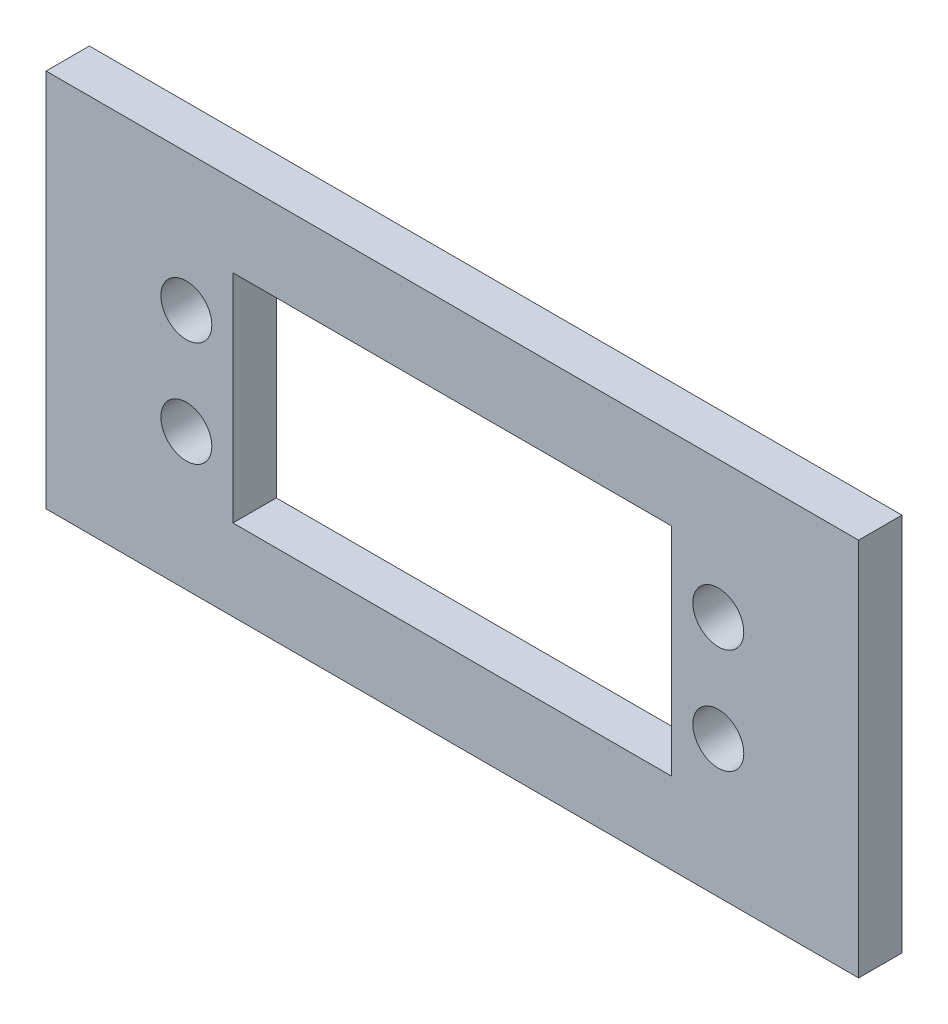
ISO-10303-21;
HEADER;
FILE_DESCRIPTION(('STEP AP214'),'2;1');
FILE_NAME('part.step','',(''),(''),'','','');
FILE_SCHEMA(('AUTOMOTIVE_DESIGN { 1 0 10303 214 1 1 1 1 }'));
ENDSEC;
DATA;
#1=APPLICATION_CONTEXT('core data for automotive mechanical design processes');
#2=APPLICATION_PROTOCOL_DEFINITION('international standard','automotive_design',2000,#1);
#3=PRODUCT_CONTEXT('',#1,'mechanical');
#4=PRODUCT('Part','Part','',(#3));
#5=PRODUCT_RELATED_PRODUCT_CATEGORY('part','',(#4));
#6=PRODUCT_DEFINITION_FORMATION('','',#4);
#7=PRODUCT_DEFINITION_CONTEXT('part definition',#1,'design');
#8=PRODUCT_DEFINITION('design','',#6,#7);
#9=PRODUCT_DEFINITION_SHAPE('','',#8);
#10=(LENGTH_UNIT() NAMED_UNIT(*) SI_UNIT(.MILLI.,.METRE.));
#11=(NAMED_UNIT(*) PLANE_ANGLE_UNIT() SI_UNIT($,.RADIAN.));
#12=(NAMED_UNIT(*) SI_UNIT($,.STERADIAN.) SOLID_ANGLE_UNIT());
#13=UNCERTAINTY_MEASURE_WITH_UNIT(LENGTH_MEASURE(1.E-05),#10,'distance_accuracy_value','');
#14=(GEOMETRIC_REPRESENTATION_CONTEXT(3) GLOBAL_UNCERTAINTY_ASSIGNED_CONTEXT((#13)) GLOBAL_UNIT_ASSIGNED_CONTEXT((#10,
#11,#12)) REPRESENTATION_CONTEXT('',''));
#15=CARTESIAN_POINT('',(0.,0.,0.));
#16=DIRECTION('',(0.,0.,1.));
#17=DIRECTION('',(1.,0.,0.));
#18=AXIS2_PLACEMENT_3D('',#15,#16,#17);
#19=CARTESIAN_POINT('',(0.,0.,4.));
#20=DIRECTION('',(0.,0.,1.));
#21=DIRECTION('',(1.,0.,0.));
#22=AXIS2_PLACEMENT_3D('',#19,#20,#21);
#23=PLANE('',#22);
#24=CARTESIAN_POINT('',(24.55,-4.85,4.));
#25=DIRECTION('',(0.,0.,1.));
#26=DIRECTION('',(1.,0.,0.));
#27=AXIS2_PLACEMENT_3D('',#24,#25,#26);
#28=CIRCLE('',#27,2.35);
#29=CARTESIAN_POINT('',(26.9,-4.85,4.));
#30=VERTEX_POINT('',#29);
#31=EDGE_CURVE('E144',#30,#30,#28,.T.);
#32=ORIENTED_EDGE('',*,*,#31,.F.);
#33=EDGE_LOOP('',(#32));
#34=FACE_BOUND('',#33,.T.);
#35=CARTESIAN_POINT('',(-24.55,4.85,4.));
#36=DIRECTION('',(0.,0.,1.));
#37=DIRECTION('',(1.,0.,0.));
#38=AXIS2_PLACEMENT_3D('',#35,#36,#37);
#39=CIRCLE('',#38,2.35);
#40=CARTESIAN_POINT('',(-22.2,4.85,4.));
#41=VERTEX_POINT('',#40);
#42=EDGE_CURVE('E156',#41,#41,#39,.T.);
#43=ORIENTED_EDGE('',*,*,#42,.F.);
#44=EDGE_LOOP('',(#43));
#45=FACE_BOUND('',#44,.T.);
#46=DIRECTION('',(0.,-1.,0.));
#47=VECTOR('',#46,1.);
#48=CARTESIAN_POINT('',(-37.5,17.5,4.));
#49=LINE('',#48,#47);
#50=CARTESIAN_POINT('',(-37.5,17.5,4.));
#51=VERTEX_POINT('',#50);
#52=CARTESIAN_POINT('',(-37.5,-17.5,4.));
#53=VERTEX_POINT('',#52);
#54=EDGE_CURVE('E162',#51,#53,#49,.T.);
#55=ORIENTED_EDGE('',*,*,#54,.T.);
#56=DIRECTION('',(1.,0.,0.));
#57=VECTOR('',#56,1.);
#58=CARTESIAN_POINT('',(-37.5,-17.5,4.));
#59=LINE('',#58,#57);
#60=CARTESIAN_POINT('',(37.5,-17.5,4.));
#61=VERTEX_POINT('',#60);
#62=EDGE_CURVE('E165',#53,#61,#59,.T.);
#63=ORIENTED_EDGE('',*,*,#62,.T.);
#64=DIRECTION('',(0.,1.,0.));
#65=VECTOR('',#64,1.);
#66=CARTESIAN_POINT('',(37.5,17.5,4.));
#67=LINE('',#66,#65);
#68=CARTESIAN_POINT('',(37.5,17.5,4.));
#69=VERTEX_POINT('',#68);
#70=EDGE_CURVE('E168',#61,#69,#67,.T.);
#71=ORIENTED_EDGE('',*,*,#70,.T.);
#72=DIRECTION('',(-1.,0.,0.));
#73=VECTOR('',#72,1.);
#74=CARTESIAN_POINT('',(-37.5,17.5,4.));
#75=LINE('',#74,#73);
#76=EDGE_CURVE('E170',#69,#51,#75,.T.);
#77=ORIENTED_EDGE('',*,*,#76,.T.);
#78=EDGE_LOOP('',(#55,#63,#71,#77));
#79=FACE_BOUND('',#78,.T.);
#80=CARTESIAN_POINT('',(-24.55,-4.85,4.));
#81=DIRECTION('',(0.,0.,1.));
#82=DIRECTION('',(1.,0.,0.));
#83=AXIS2_PLACEMENT_3D('',#80,#81,#82);
#84=CIRCLE('',#83,2.34999999999999);
#85=CARTESIAN_POINT('',(-22.2,-4.85,4.));
#86=VERTEX_POINT('',#85);
#87=EDGE_CURVE('E150',#86,#86,#84,.T.);
#88=ORIENTED_EDGE('',*,*,#87,.F.);
#89=EDGE_LOOP('',(#88));
#90=FACE_BOUND('',#89,.T.);
#91=CARTESIAN_POINT('',(24.55,4.85,4.));
#92=DIRECTION('',(0.,0.,1.));
#93=DIRECTION('',(1.,0.,0.));
#94=AXIS2_PLACEMENT_3D('',#91,#92,#93);
#95=CIRCLE('',#94,2.35);
#96=CARTESIAN_POINT('',(26.9,4.85,4.));
#97=VERTEX_POINT('',#96);
#98=EDGE_CURVE('E138',#97,#97,#95,.T.);
#99=ORIENTED_EDGE('',*,*,#98,.F.);
#100=EDGE_LOOP('',(#99));
#101=FACE_BOUND('',#100,.T.);
#102=DIRECTION('',(1.,0.,0.));
#103=VECTOR('',#102,1.);
#104=CARTESIAN_POINT('',(-20.25,-10.,4.));
#105=LINE('',#104,#103);
#106=CARTESIAN_POINT('',(-20.25,-10.,4.));
#107=VERTEX_POINT('',#106);
#108=CARTESIAN_POINT('',(20.25,-10.,4.));
#109=VERTEX_POINT('',#108);
#110=EDGE_CURVE('E110',#107,#109,#105,.T.);
#111=ORIENTED_EDGE('',*,*,#110,.F.);
#112=DIRECTION('',(0.,-1.,0.));
#113=VECTOR('',#112,1.);
#114=CARTESIAN_POINT('',(-20.25,10.,4.));
#115=LINE('',#114,#113);
#116=CARTESIAN_POINT('',(-20.25,10.,4.));
#117=VERTEX_POINT('',#116);
#118=EDGE_CURVE('E102',#117,#107,#115,.T.);
#119=ORIENTED_EDGE('',*,*,#118,.F.);
#120=DIRECTION('',(-1.,0.,0.));
#121=VECTOR('',#120,1.);
#122=CARTESIAN_POINT('',(-20.25,10.,4.));
#123=LINE('',#122,#121);
#124=CARTESIAN_POINT('',(20.25,10.,4.));
#125=VERTEX_POINT('',#124);
#126=EDGE_CURVE('E124',#125,#117,#123,.T.);
#127=ORIENTED_EDGE('',*,*,#126,.F.);
#128=DIRECTION('',(0.,1.,0.));
#129=VECTOR('',#128,1.);
#130=CARTESIAN_POINT('',(20.25,10.,4.));
#131=LINE('',#130,#129);
#132=EDGE_CURVE('E122',#109,#125,#131,.T.);
#133=ORIENTED_EDGE('',*,*,#132,.F.);
#134=EDGE_LOOP('',(#111,#119,#127,#133));
#135=FACE_BOUND('',#134,.T.);
#136=ADVANCED_FACE('F37',(#34,#45,#79,#90,#101,#135),#23,.T.);
#137=CARTESIAN_POINT('',(0.,0.,0.));
#138=DIRECTION('',(0.,0.,1.));
#139=DIRECTION('',(1.,0.,0.));
#140=AXIS2_PLACEMENT_3D('',#137,#138,#139);
#141=PLANE('',#140);
#142=CARTESIAN_POINT('',(24.55,4.85,0.));
#143=DIRECTION('',(0.,0.,1.));
#144=DIRECTION('',(1.,0.,0.));
#145=AXIS2_PLACEMENT_3D('',#142,#143,#144);
#146=CIRCLE('',#145,2.35);
#147=CARTESIAN_POINT('',(26.9,4.85,0.));
#148=VERTEX_POINT('',#147);
#149=EDGE_CURVE('E118',#148,#148,#146,.T.);
#150=ORIENTED_EDGE('',*,*,#149,.T.);
#151=EDGE_LOOP('',(#150));
#152=FACE_BOUND('',#151,.T.);
#153=CARTESIAN_POINT('',(24.55,-4.85,0.));
#154=DIRECTION('',(0.,0.,1.));
#155=DIRECTION('',(1.,0.,0.));
#156=AXIS2_PLACEMENT_3D('',#153,#154,#155);
#157=CIRCLE('',#156,2.35);
#158=CARTESIAN_POINT('',(26.9,-4.85,0.));
#159=VERTEX_POINT('',#158);
#160=EDGE_CURVE('E141',#159,#159,#157,.T.);
#161=ORIENTED_EDGE('',*,*,#160,.T.);
#162=EDGE_LOOP('',(#161));
#163=FACE_BOUND('',#162,.T.);
#164=CARTESIAN_POINT('',(-24.55,-4.85,0.));
#165=DIRECTION('',(0.,0.,1.));
#166=DIRECTION('',(1.,0.,0.));
#167=AXIS2_PLACEMENT_3D('',#164,#165,#166);
#168=CIRCLE('',#167,2.34999999999999);
#169=CARTESIAN_POINT('',(-22.2,-4.85,0.));
#170=VERTEX_POINT('',#169);
#171=EDGE_CURVE('E147',#170,#170,#168,.T.);
#172=ORIENTED_EDGE('',*,*,#171,.T.);
#173=EDGE_LOOP('',(#172));
#174=FACE_BOUND('',#173,.T.);
#175=CARTESIAN_POINT('',(-24.55,4.85,0.));
#176=DIRECTION('',(0.,0.,1.));
#177=DIRECTION('',(1.,0.,0.));
#178=AXIS2_PLACEMENT_3D('',#175,#176,#177);
#179=CIRCLE('',#178,2.35);
#180=CARTESIAN_POINT('',(-22.2,4.85,0.));
#181=VERTEX_POINT('',#180);
#182=EDGE_CURVE('E153',#181,#181,#179,.T.);
#183=ORIENTED_EDGE('',*,*,#182,.T.);
#184=EDGE_LOOP('',(#183));
#185=FACE_BOUND('',#184,.T.);
#186=DIRECTION('',(0.,-1.,0.));
#187=VECTOR('',#186,1.);
#188=CARTESIAN_POINT('',(-37.5,17.5,0.));
#189=LINE('',#188,#187);
#190=CARTESIAN_POINT('',(-37.5,17.5,0.));
#191=VERTEX_POINT('',#190);
#192=CARTESIAN_POINT('',(-37.5,-17.5,0.));
#193=VERTEX_POINT('',#192);
#194=EDGE_CURVE('E159',#191,#193,#189,.T.);
#195=ORIENTED_EDGE('',*,*,#194,.F.);
#196=DIRECTION('',(-1.,0.,0.));
#197=VECTOR('',#196,1.);
#198=CARTESIAN_POINT('',(-37.5,17.5,0.));
#199=LINE('',#198,#197);
#200=CARTESIAN_POINT('',(37.5,17.5,0.));
#201=VERTEX_POINT('',#200);
#202=EDGE_CURVE('E166',#201,#191,#199,.T.);
#203=ORIENTED_EDGE('',*,*,#202,.F.);
#204=DIRECTION('',(0.,1.,0.));
#205=VECTOR('',#204,1.);
#206=CARTESIAN_POINT('',(37.5,17.5,0.));
#207=LINE('',#206,#205);
#208=CARTESIAN_POINT('',(37.5,-17.5,0.));
#209=VERTEX_POINT('',#208);
#210=EDGE_CURVE('E177',#209,#201,#207,.T.);
#211=ORIENTED_EDGE('',*,*,#210,.F.);
#212=DIRECTION('',(1.,0.,0.));
#213=VECTOR('',#212,1.);
#214=CARTESIAN_POINT('',(-37.5,-17.5,0.));
#215=LINE('',#214,#213);
#216=EDGE_CURVE('E175',#193,#209,#215,.T.);
#217=ORIENTED_EDGE('',*,*,#216,.F.);
#218=EDGE_LOOP('',(#195,#203,#211,#217));
#219=FACE_BOUND('',#218,.T.);
#220=DIRECTION('',(0.,-1.,0.));
#221=VECTOR('',#220,1.);
#222=CARTESIAN_POINT('',(-20.25,10.,0.));
#223=LINE('',#222,#221);
#224=CARTESIAN_POINT('',(-20.25,10.,0.));
#225=VERTEX_POINT('',#224);
#226=CARTESIAN_POINT('',(-20.25,-10.,0.));
#227=VERTEX_POINT('',#226);
#228=EDGE_CURVE('E60',#225,#227,#223,.T.);
#229=ORIENTED_EDGE('',*,*,#228,.T.);
#230=DIRECTION('',(1.,0.,0.));
#231=VECTOR('',#230,1.);
#232=CARTESIAN_POINT('',(-20.25,-10.,0.));
#233=LINE('',#232,#231);
#234=CARTESIAN_POINT('',(20.25,-10.,0.));
#235=VERTEX_POINT('',#234);
#236=EDGE_CURVE('E117',#227,#235,#233,.T.);
#237=ORIENTED_EDGE('',*,*,#236,.T.);
#238=DIRECTION('',(0.,1.,0.));
#239=VECTOR('',#238,1.);
#240=CARTESIAN_POINT('',(20.25,10.,0.));
#241=LINE('',#240,#239);
#242=CARTESIAN_POINT('',(20.25,10.,0.));
#243=VERTEX_POINT('',#242);
#244=EDGE_CURVE('E130',#235,#243,#241,.T.);
#245=ORIENTED_EDGE('',*,*,#244,.T.);
#246=DIRECTION('',(-1.,0.,0.));
#247=VECTOR('',#246,1.);
#248=CARTESIAN_POINT('',(-20.25,10.,0.));
#249=LINE('',#248,#247);
#250=EDGE_CURVE('E111',#243,#225,#249,.T.);
#251=ORIENTED_EDGE('',*,*,#250,.T.);
#252=EDGE_LOOP('',(#229,#237,#245,#251));
#253=FACE_BOUND('',#252,.T.);
#254=ADVANCED_FACE('F195',(#152,#163,#174,#185,#219,#253),#141,.F.);
#255=CARTESIAN_POINT('',(-37.5,17.5,4.));
#256=DIRECTION('',(1.,0.,0.));
#257=DIRECTION('',(0.,0.,-1.));
#258=AXIS2_PLACEMENT_3D('',#255,#256,#257);
#259=PLANE('',#258);
#260=ORIENTED_EDGE('',*,*,#194,.T.);
#261=DIRECTION('',(0.,0.,-1.));
#262=VECTOR('',#261,1.);
#263=CARTESIAN_POINT('',(-37.5,-17.5,4.));
#264=LINE('',#263,#262);
#265=EDGE_CURVE('E11',#53,#193,#264,.T.);
#266=ORIENTED_EDGE('',*,*,#265,.F.);
#267=ORIENTED_EDGE('',*,*,#54,.F.);
#268=DIRECTION('',(0.,0.,-1.));
#269=VECTOR('',#268,1.);
#270=CARTESIAN_POINT('',(-37.5,17.5,4.));
#271=LINE('',#270,#269);
#272=EDGE_CURVE('E172',#51,#191,#271,.T.);
#273=ORIENTED_EDGE('',*,*,#272,.T.);
#274=EDGE_LOOP('',(#260,#266,#267,#273));
#275=FACE_BOUND('',#274,.T.);
#276=ADVANCED_FACE('F39',(#275),#259,.F.);
#277=CARTESIAN_POINT('',(-37.5,-17.5,4.));
#278=DIRECTION('',(0.,1.,0.));
#279=DIRECTION('',(0.,0.,1.));
#280=AXIS2_PLACEMENT_3D('',#277,#278,#279);
#281=PLANE('',#280);
#282=ORIENTED_EDGE('',*,*,#216,.T.);
#283=DIRECTION('',(0.,0.,-1.));
#284=VECTOR('',#283,1.);
#285=CARTESIAN_POINT('',(37.5,-17.5,4.));
#286=LINE('',#285,#284);
#287=EDGE_CURVE('E45',#61,#209,#286,.T.);
#288=ORIENTED_EDGE('',*,*,#287,.F.);
#289=ORIENTED_EDGE('',*,*,#62,.F.);
#290=ORIENTED_EDGE('',*,*,#265,.T.);
#291=EDGE_LOOP('',(#282,#288,#289,#290));
#292=FACE_BOUND('',#291,.T.);
#293=ADVANCED_FACE('F206',(#292),#281,.F.);
#294=CARTESIAN_POINT('',(37.5,17.5,4.));
#295=DIRECTION('',(-1.,0.,0.));
#296=DIRECTION('',(0.,0.,1.));
#297=AXIS2_PLACEMENT_3D('',#294,#295,#296);
#298=PLANE('',#297);
#299=ORIENTED_EDGE('',*,*,#210,.T.);
#300=DIRECTION('',(0.,0.,-1.));
#301=VECTOR('',#300,1.);
#302=CARTESIAN_POINT('',(37.5,17.5,4.));
#303=LINE('',#302,#301);
#304=EDGE_CURVE('E182',#69,#201,#303,.T.);
#305=ORIENTED_EDGE('',*,*,#304,.F.);
#306=ORIENTED_EDGE('',*,*,#70,.F.);
#307=ORIENTED_EDGE('',*,*,#287,.T.);
#308=EDGE_LOOP('',(#299,#305,#306,#307));
#309=FACE_BOUND('',#308,.T.);
#310=ADVANCED_FACE('F189',(#309),#298,.F.);
#311=CARTESIAN_POINT('',(-37.5,17.5,4.));
#312=DIRECTION('',(0.,-1.,0.));
#313=DIRECTION('',(0.,0.,-1.));
#314=AXIS2_PLACEMENT_3D('',#311,#312,#313);
#315=PLANE('',#314);
#316=ORIENTED_EDGE('',*,*,#202,.T.);
#317=ORIENTED_EDGE('',*,*,#272,.F.);
#318=ORIENTED_EDGE('',*,*,#76,.F.);
#319=ORIENTED_EDGE('',*,*,#304,.T.);
#320=EDGE_LOOP('',(#316,#317,#318,#319));
#321=FACE_BOUND('',#320,.T.);
#322=ADVANCED_FACE('F199',(#321),#315,.F.);
#323=CARTESIAN_POINT('',(-24.55,4.85,4.));
#324=DIRECTION('',(0.,0.,-1.));
#325=DIRECTION('',(-1.,0.,0.));
#326=AXIS2_PLACEMENT_3D('',#323,#324,#325);
#327=CYLINDRICAL_SURFACE('',#326,2.35);
#328=ORIENTED_EDGE('',*,*,#42,.T.);
#329=EDGE_LOOP('',(#328));
#330=FACE_BOUND('',#329,.T.);
#331=ORIENTED_EDGE('',*,*,#182,.F.);
#332=EDGE_LOOP('',(#331));
#333=FACE_BOUND('',#332,.T.);
#334=ADVANCED_FACE('F224',(#330,#333),#327,.F.);
#335=CARTESIAN_POINT('',(-24.55,-4.85,4.));
#336=DIRECTION('',(0.,0.,-1.));
#337=DIRECTION('',(-1.,0.,0.));
#338=AXIS2_PLACEMENT_3D('',#335,#336,#337);
#339=CYLINDRICAL_SURFACE('',#338,2.34999999999999);
#340=ORIENTED_EDGE('',*,*,#87,.T.);
#341=EDGE_LOOP('',(#340));
#342=FACE_BOUND('',#341,.T.);
#343=ORIENTED_EDGE('',*,*,#171,.F.);
#344=EDGE_LOOP('',(#343));
#345=FACE_BOUND('',#344,.T.);
#346=ADVANCED_FACE('F231',(#342,#345),#339,.F.);
#347=CARTESIAN_POINT('',(24.55,-4.85,4.));
#348=DIRECTION('',(0.,0.,-1.));
#349=DIRECTION('',(-1.,0.,0.));
#350=AXIS2_PLACEMENT_3D('',#347,#348,#349);
#351=CYLINDRICAL_SURFACE('',#350,2.35);
#352=ORIENTED_EDGE('',*,*,#31,.T.);
#353=EDGE_LOOP('',(#352));
#354=FACE_BOUND('',#353,.T.);
#355=ORIENTED_EDGE('',*,*,#160,.F.);
#356=EDGE_LOOP('',(#355));
#357=FACE_BOUND('',#356,.T.);
#358=ADVANCED_FACE('F236',(#354,#357),#351,.F.);
#359=CARTESIAN_POINT('',(24.55,4.85,4.));
#360=DIRECTION('',(0.,0.,-1.));
#361=DIRECTION('',(-1.,0.,0.));
#362=AXIS2_PLACEMENT_3D('',#359,#360,#361);
#363=CYLINDRICAL_SURFACE('',#362,2.35);
#364=ORIENTED_EDGE('',*,*,#98,.T.);
#365=EDGE_LOOP('',(#364));
#366=FACE_BOUND('',#365,.T.);
#367=ORIENTED_EDGE('',*,*,#149,.F.);
#368=EDGE_LOOP('',(#367));
#369=FACE_BOUND('',#368,.T.);
#370=ADVANCED_FACE('F245',(#366,#369),#363,.F.);
#371=CARTESIAN_POINT('',(-20.25,10.,4.));
#372=DIRECTION('',(1.,0.,0.));
#373=DIRECTION('',(0.,0.,-1.));
#374=AXIS2_PLACEMENT_3D('',#371,#372,#373);
#375=PLANE('',#374);
#376=ORIENTED_EDGE('',*,*,#228,.F.);
#377=DIRECTION('',(0.,0.,-1.));
#378=VECTOR('',#377,1.);
#379=CARTESIAN_POINT('',(-20.25,10.,4.));
#380=LINE('',#379,#378);
#381=EDGE_CURVE('E106',#117,#225,#380,.T.);
#382=ORIENTED_EDGE('',*,*,#381,.F.);
#383=ORIENTED_EDGE('',*,*,#118,.T.);
#384=DIRECTION('',(0.,0.,-1.));
#385=VECTOR('',#384,1.);
#386=CARTESIAN_POINT('',(-20.25,-10.,4.));
#387=LINE('',#386,#385);
#388=EDGE_CURVE('E105',#107,#227,#387,.T.);
#389=ORIENTED_EDGE('',*,*,#388,.T.);
#390=EDGE_LOOP('',(#376,#382,#383,#389));
#391=FACE_BOUND('',#390,.T.);
#392=ADVANCED_FACE('F104',(#391),#375,.T.);
#393=CARTESIAN_POINT('',(-20.25,-10.,4.));
#394=DIRECTION('',(0.,1.,0.));
#395=DIRECTION('',(0.,0.,1.));
#396=AXIS2_PLACEMENT_3D('',#393,#394,#395);
#397=PLANE('',#396);
#398=ORIENTED_EDGE('',*,*,#236,.F.);
#399=ORIENTED_EDGE('',*,*,#388,.F.);
#400=ORIENTED_EDGE('',*,*,#110,.T.);
#401=DIRECTION('',(0.,0.,-1.));
#402=VECTOR('',#401,1.);
#403=CARTESIAN_POINT('',(20.25,-10.,4.));
#404=LINE('',#403,#402);
#405=EDGE_CURVE('E119',#109,#235,#404,.T.);
#406=ORIENTED_EDGE('',*,*,#405,.T.);
#407=EDGE_LOOP('',(#398,#399,#400,#406));
#408=FACE_BOUND('',#407,.T.);
#409=ADVANCED_FACE('F114',(#408),#397,.T.);
#410=CARTESIAN_POINT('',(20.25,10.,4.));
#411=DIRECTION('',(-1.,0.,0.));
#412=DIRECTION('',(0.,0.,1.));
#413=AXIS2_PLACEMENT_3D('',#410,#411,#412);
#414=PLANE('',#413);
#415=ORIENTED_EDGE('',*,*,#244,.F.);
#416=ORIENTED_EDGE('',*,*,#405,.F.);
#417=ORIENTED_EDGE('',*,*,#132,.T.);
#418=DIRECTION('',(0.,0.,-1.));
#419=VECTOR('',#418,1.);
#420=CARTESIAN_POINT('',(20.25,10.,4.));
#421=LINE('',#420,#419);
#422=EDGE_CURVE('E52',#125,#243,#421,.T.);
#423=ORIENTED_EDGE('',*,*,#422,.T.);
#424=EDGE_LOOP('',(#415,#416,#417,#423));
#425=FACE_BOUND('',#424,.T.);
#426=ADVANCED_FACE('F257',(#425),#414,.T.);
#427=CARTESIAN_POINT('',(-20.25,10.,4.));
#428=DIRECTION('',(0.,-1.,0.));
#429=DIRECTION('',(0.,0.,-1.));
#430=AXIS2_PLACEMENT_3D('',#427,#428,#429);
#431=PLANE('',#430);
#432=ORIENTED_EDGE('',*,*,#250,.F.);
#433=ORIENTED_EDGE('',*,*,#422,.F.);
#434=ORIENTED_EDGE('',*,*,#126,.T.);
#435=ORIENTED_EDGE('',*,*,#381,.T.);
#436=EDGE_LOOP('',(#432,#433,#434,#435));
#437=FACE_BOUND('',#436,.T.);
#438=ADVANCED_FACE('F260',(#437),#431,.T.);
#439=CLOSED_SHELL('',(#136,#254,#276,#293,#310,#322,#334,#346,#358,#370,#392,#409,#426,#438));
#440=MANIFOLD_SOLID_BREP('B2',#439);
#441=ADVANCED_BREP_SHAPE_REPRESENTATION('',(#18,#440),#14);
#442=SHAPE_DEFINITION_REPRESENTATION(#9,#441);
ENDSEC;
END-ISO-10303-21;
